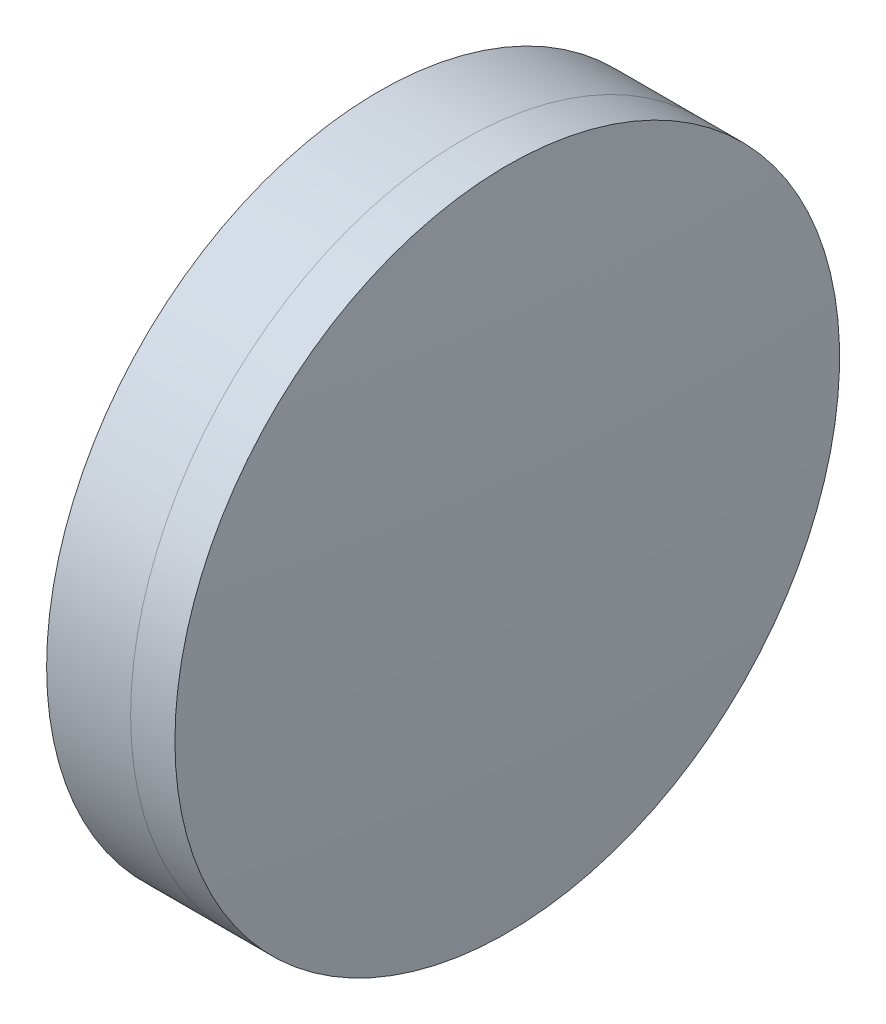
ISO-10303-21;
HEADER;
FILE_DESCRIPTION(('STEP AP214'),'2;1');
FILE_NAME('part.step','',(''),(''),'','','');
FILE_SCHEMA(('AUTOMOTIVE_DESIGN { 1 0 10303 214 1 1 1 1 }'));
ENDSEC;
DATA;
#1=APPLICATION_CONTEXT('core data for automotive mechanical design processes');
#2=APPLICATION_PROTOCOL_DEFINITION('international standard','automotive_design',2000,#1);
#3=PRODUCT_CONTEXT('',#1,'mechanical');
#4=PRODUCT('Part','Part','',(#3));
#5=PRODUCT_RELATED_PRODUCT_CATEGORY('part','',(#4));
#6=PRODUCT_DEFINITION_FORMATION('','',#4);
#7=PRODUCT_DEFINITION_CONTEXT('part definition',#1,'design');
#8=PRODUCT_DEFINITION('design','',#6,#7);
#9=PRODUCT_DEFINITION_SHAPE('','',#8);
#10=(LENGTH_UNIT() NAMED_UNIT(*) SI_UNIT(.MILLI.,.METRE.));
#11=(NAMED_UNIT(*) PLANE_ANGLE_UNIT() SI_UNIT($,.RADIAN.));
#12=(NAMED_UNIT(*) SI_UNIT($,.STERADIAN.) SOLID_ANGLE_UNIT());
#13=UNCERTAINTY_MEASURE_WITH_UNIT(LENGTH_MEASURE(1.E-05),#10,'distance_accuracy_value','');
#14=(GEOMETRIC_REPRESENTATION_CONTEXT(3) GLOBAL_UNCERTAINTY_ASSIGNED_CONTEXT((#13)) GLOBAL_UNIT_ASSIGNED_CONTEXT((#10,
#11,#12)) REPRESENTATION_CONTEXT('',''));
#15=CARTESIAN_POINT('',(0.,0.,0.));
#16=DIRECTION('',(0.,0.,1.));
#17=DIRECTION('',(1.,0.,0.));
#18=AXIS2_PLACEMENT_3D('',#15,#16,#17);
#19=CARTESIAN_POINT('',(317.206965225082,0.,0.));
#20=DIRECTION('',(-1.,0.,0.));
#21=DIRECTION('',(0.,0.,1.));
#22=AXIS2_PLACEMENT_3D('',#19,#20,#21);
#23=SPHERICAL_SURFACE('',#22,216.3);
#24=CARTESIAN_POINT('',(532.986227435333,0.,0.));
#25=DIRECTION('',(-1.,0.,0.));
#26=DIRECTION('',(0.,0.,1.));
#27=AXIS2_PLACEMENT_3D('',#24,#25,#26);
#28=CIRCLE('',#27,14.9999999999997);
#29=CARTESIAN_POINT('',(532.986227435333,0.,14.9999999999997));
#30=VERTEX_POINT('',#29);
#31=EDGE_CURVE('E11',#30,#30,#28,.T.);
#32=ORIENTED_EDGE('',*,*,#31,.T.);
#33=EDGE_LOOP('',(#32));
#34=FACE_BOUND('',#33,.T.);
#35=ADVANCED_FACE('F45',(#34),#23,.F.);
#36=CARTESIAN_POINT('',(-0.551919992657797,0.,0.));
#37=DIRECTION('',(-1.,0.,0.));
#38=DIRECTION('',(0.,0.,1.));
#39=AXIS2_PLACEMENT_3D('',#36,#37,#38);
#40=CYLINDRICAL_SURFACE('',#39,14.9999999999997);
#41=CARTESIAN_POINT('',(534.986227435333,0.,0.));
#42=DIRECTION('',(-1.,0.,0.));
#43=DIRECTION('',(0.,0.,1.));
#44=AXIS2_PLACEMENT_3D('',#41,#42,#43);
#45=CIRCLE('',#44,14.9999999999996);
#46=CARTESIAN_POINT('',(534.986227435333,0.,14.9999999999996));
#47=VERTEX_POINT('',#46);
#48=EDGE_CURVE('E51',#47,#47,#45,.T.);
#49=ORIENTED_EDGE('',*,*,#48,.T.);
#50=EDGE_LOOP('',(#49));
#51=FACE_BOUND('',#50,.T.);
#52=ORIENTED_EDGE('',*,*,#31,.F.);
#53=EDGE_LOOP('',(#52));
#54=FACE_BOUND('',#53,.T.);
#55=ADVANCED_FACE('F57',(#51,#54),#40,.T.);
#56=CARTESIAN_POINT('',(319.206965225082,0.,0.));
#57=DIRECTION('',(-1.,0.,0.));
#58=DIRECTION('',(0.,0.,1.));
#59=AXIS2_PLACEMENT_3D('',#56,#57,#58);
#60=SPHERICAL_SURFACE('',#59,216.3);
#61=ORIENTED_EDGE('',*,*,#48,.F.);
#62=EDGE_LOOP('',(#61));
#63=FACE_BOUND('',#62,.T.);
#64=ADVANCED_FACE('F60',(#63),#60,.T.);
#65=CLOSED_SHELL('',(#35,#55,#64));
#66=MANIFOLD_SOLID_BREP('B2',#65);
#67=CARTESIAN_POINT('',(579.506965225082,0.,-4.78700530445869E-13));
#68=DIRECTION('',(-1.,0.,0.));
#69=DIRECTION('',(0.,0.,1.));
#70=AXIS2_PLACEMENT_3D('',#67,#68,#69);
#71=SPHERICAL_SURFACE('',#70,52.5);
#72=CARTESIAN_POINT('',(529.195435731337,0.,0.));
#73=DIRECTION('',(-1.,0.,0.));
#74=DIRECTION('',(0.,0.,1.));
#75=AXIS2_PLACEMENT_3D('',#72,#73,#74);
#76=CIRCLE('',#75,14.9999999999996);
#77=CARTESIAN_POINT('',(529.195435731337,0.,14.9999999999996));
#78=VERTEX_POINT('',#77);
#79=EDGE_CURVE('E44',#78,#78,#76,.T.);
#80=ORIENTED_EDGE('',*,*,#79,.T.);
#81=EDGE_LOOP('',(#80));
#82=FACE_BOUND('',#81,.T.);
#83=ADVANCED_FACE('F86',(#82),#71,.T.);
#84=CARTESIAN_POINT('',(124.523309526045,0.,0.));
#85=DIRECTION('',(-1.,0.,0.));
#86=DIRECTION('',(0.,0.,1.));
#87=AXIS2_PLACEMENT_3D('',#84,#85,#86);
#88=CYLINDRICAL_SURFACE('',#87,14.9999999999996);
#89=CARTESIAN_POINT('',(532.986227435333,0.,0.));
#90=DIRECTION('',(-1.,0.,0.));
#91=DIRECTION('',(0.,0.,1.));
#92=AXIS2_PLACEMENT_3D('',#89,#90,#91);
#93=CIRCLE('',#92,14.9999999999996);
#94=CARTESIAN_POINT('',(532.986227435333,0.,14.9999999999996));
#95=VERTEX_POINT('',#94);
#96=EDGE_CURVE('E92',#95,#95,#93,.T.);
#97=ORIENTED_EDGE('',*,*,#96,.T.);
#98=EDGE_LOOP('',(#97));
#99=FACE_BOUND('',#98,.T.);
#100=ORIENTED_EDGE('',*,*,#79,.F.);
#101=EDGE_LOOP('',(#100));
#102=FACE_BOUND('',#101,.T.);
#103=ADVANCED_FACE('F98',(#99,#102),#88,.T.);
#104=CARTESIAN_POINT('',(317.206965225082,0.,0.));
#105=DIRECTION('',(-1.,0.,0.));
#106=DIRECTION('',(0.,0.,1.));
#107=AXIS2_PLACEMENT_3D('',#104,#105,#106);
#108=SPHERICAL_SURFACE('',#107,216.3);
#109=ORIENTED_EDGE('',*,*,#96,.F.);
#110=EDGE_LOOP('',(#109));
#111=FACE_BOUND('',#110,.T.);
#112=ADVANCED_FACE('F101',(#111),#108,.T.);
#113=CLOSED_SHELL('',(#83,#103,#112));
#114=MANIFOLD_SOLID_BREP('B6',#113);
#115=ADVANCED_BREP_SHAPE_REPRESENTATION('',(#18,#66,#114),#14);
#116=SHAPE_DEFINITION_REPRESENTATION(#9,#115);
ENDSEC;
END-ISO-10303-21;
